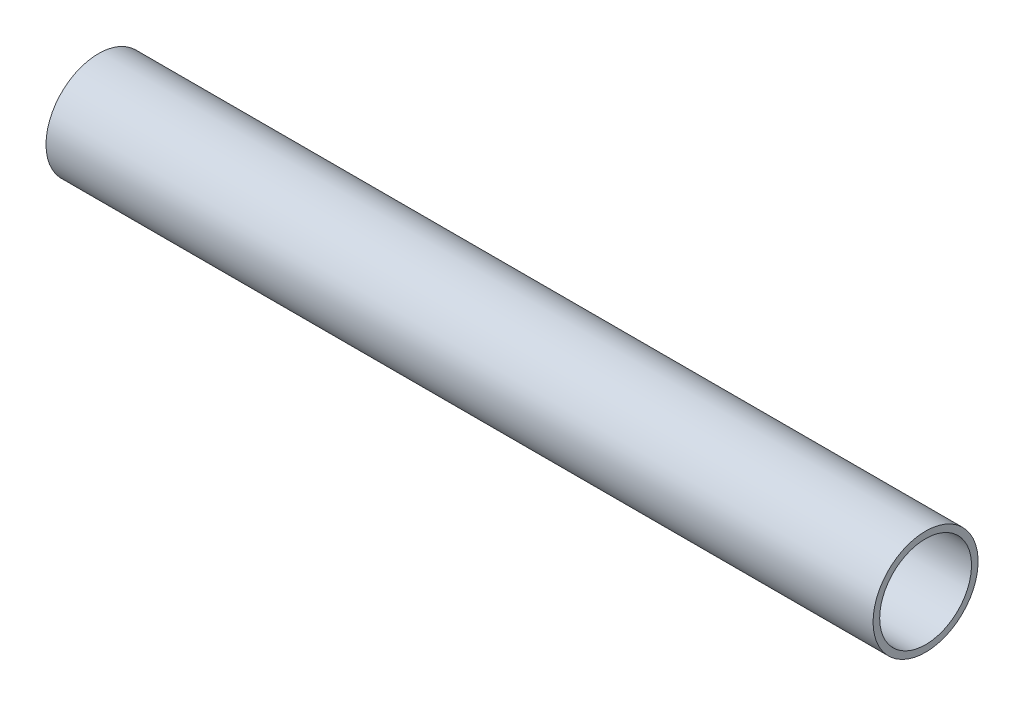
ISO-10303-21;
HEADER;
FILE_DESCRIPTION(('STEP AP214'),'2;1');
FILE_NAME('part.step','',(''),(''),'','','');
FILE_SCHEMA(('AUTOMOTIVE_DESIGN { 1 0 10303 214 1 1 1 1 }'));
ENDSEC;
DATA;
#1=APPLICATION_CONTEXT('core data for automotive mechanical design processes');
#2=APPLICATION_PROTOCOL_DEFINITION('international standard','automotive_design',2000,#1);
#3=PRODUCT_CONTEXT('',#1,'mechanical');
#4=PRODUCT('Part','Part','',(#3));
#5=PRODUCT_RELATED_PRODUCT_CATEGORY('part','',(#4));
#6=PRODUCT_DEFINITION_FORMATION('','',#4);
#7=PRODUCT_DEFINITION_CONTEXT('part definition',#1,'design');
#8=PRODUCT_DEFINITION('design','',#6,#7);
#9=PRODUCT_DEFINITION_SHAPE('','',#8);
#10=(LENGTH_UNIT() NAMED_UNIT(*) SI_UNIT(.MILLI.,.METRE.));
#11=(NAMED_UNIT(*) PLANE_ANGLE_UNIT() SI_UNIT($,.RADIAN.));
#12=(NAMED_UNIT(*) SI_UNIT($,.STERADIAN.) SOLID_ANGLE_UNIT());
#13=UNCERTAINTY_MEASURE_WITH_UNIT(LENGTH_MEASURE(1.E-05),#10,'distance_accuracy_value','');
#14=(GEOMETRIC_REPRESENTATION_CONTEXT(3) GLOBAL_UNCERTAINTY_ASSIGNED_CONTEXT((#13)) GLOBAL_UNIT_ASSIGNED_CONTEXT((#10,
#11,#12)) REPRESENTATION_CONTEXT('',''));
#15=CARTESIAN_POINT('',(0.,0.,0.));
#16=DIRECTION('',(0.,0.,1.));
#17=DIRECTION('',(1.,0.,0.));
#18=AXIS2_PLACEMENT_3D('',#15,#16,#17);
#19=CARTESIAN_POINT('',(600.,38.1,0.));
#20=DIRECTION('',(-1.,0.,0.));
#21=DIRECTION('',(0.,0.,1.));
#22=AXIS2_PLACEMENT_3D('',#19,#20,#21);
#23=PLANE('',#22);
#24=CARTESIAN_POINT('',(600.,0.,0.));
#25=DIRECTION('',(-1.,0.,0.));
#26=DIRECTION('',(0.,0.,1.));
#27=AXIS2_PLACEMENT_3D('',#24,#25,#26);
#28=CIRCLE('',#27,38.1);
#29=CARTESIAN_POINT('',(600.,0.,38.1));
#30=VERTEX_POINT('',#29);
#31=EDGE_CURVE('E10',#30,#30,#28,.T.);
#32=ORIENTED_EDGE('',*,*,#31,.F.);
#33=EDGE_LOOP('',(#32));
#34=FACE_BOUND('',#33,.T.);
#35=CARTESIAN_POINT('',(600.,0.,0.));
#36=DIRECTION('',(-1.,0.,0.));
#37=DIRECTION('',(0.,0.,1.));
#38=AXIS2_PLACEMENT_3D('',#35,#36,#37);
#39=CIRCLE('',#38,33.3);
#40=CARTESIAN_POINT('',(600.,0.,33.3));
#41=VERTEX_POINT('',#40);
#42=EDGE_CURVE('E44',#41,#41,#39,.T.);
#43=ORIENTED_EDGE('',*,*,#42,.T.);
#44=EDGE_LOOP('',(#43));
#45=FACE_BOUND('',#44,.T.);
#46=ADVANCED_FACE('F30',(#34,#45),#23,.F.);
#47=CARTESIAN_POINT('',(0.,0.,0.));
#48=DIRECTION('',(-1.,0.,0.));
#49=DIRECTION('',(0.,0.,1.));
#50=AXIS2_PLACEMENT_3D('',#47,#48,#49);
#51=CYLINDRICAL_SURFACE('',#50,38.1);
#52=CARTESIAN_POINT('',(0.,0.,0.));
#53=DIRECTION('',(-1.,0.,0.));
#54=DIRECTION('',(0.,0.,1.));
#55=AXIS2_PLACEMENT_3D('',#52,#53,#54);
#56=CIRCLE('',#55,38.1);
#57=CARTESIAN_POINT('',(0.,0.,38.1));
#58=VERTEX_POINT('',#57);
#59=EDGE_CURVE('E36',#58,#58,#56,.T.);
#60=ORIENTED_EDGE('',*,*,#59,.F.);
#61=EDGE_LOOP('',(#60));
#62=FACE_BOUND('',#61,.T.);
#63=ORIENTED_EDGE('',*,*,#31,.T.);
#64=EDGE_LOOP('',(#63));
#65=FACE_BOUND('',#64,.T.);
#66=ADVANCED_FACE('F59',(#62,#65),#51,.T.);
#67=CARTESIAN_POINT('',(0.,33.3,0.));
#68=DIRECTION('',(1.,0.,0.));
#69=DIRECTION('',(0.,0.,-1.));
#70=AXIS2_PLACEMENT_3D('',#67,#68,#69);
#71=PLANE('',#70);
#72=CARTESIAN_POINT('',(0.,0.,0.));
#73=DIRECTION('',(-1.,0.,0.));
#74=DIRECTION('',(0.,0.,1.));
#75=AXIS2_PLACEMENT_3D('',#72,#73,#74);
#76=CIRCLE('',#75,33.3);
#77=CARTESIAN_POINT('',(0.,0.,33.3));
#78=VERTEX_POINT('',#77);
#79=EDGE_CURVE('E40',#78,#78,#76,.T.);
#80=ORIENTED_EDGE('',*,*,#79,.F.);
#81=EDGE_LOOP('',(#80));
#82=FACE_BOUND('',#81,.T.);
#83=ORIENTED_EDGE('',*,*,#59,.T.);
#84=EDGE_LOOP('',(#83));
#85=FACE_BOUND('',#84,.T.);
#86=ADVANCED_FACE('F54',(#82,#85),#71,.F.);
#87=CARTESIAN_POINT('',(0.,0.,0.));
#88=DIRECTION('',(-1.,0.,0.));
#89=DIRECTION('',(0.,0.,1.));
#90=AXIS2_PLACEMENT_3D('',#87,#88,#89);
#91=CYLINDRICAL_SURFACE('',#90,33.3);
#92=ORIENTED_EDGE('',*,*,#42,.F.);
#93=EDGE_LOOP('',(#92));
#94=FACE_BOUND('',#93,.T.);
#95=ORIENTED_EDGE('',*,*,#79,.T.);
#96=EDGE_LOOP('',(#95));
#97=FACE_BOUND('',#96,.T.);
#98=ADVANCED_FACE('F51',(#94,#97),#91,.F.);
#99=CLOSED_SHELL('',(#46,#66,#86,#98));
#100=MANIFOLD_SOLID_BREP('B2',#99);
#101=ADVANCED_BREP_SHAPE_REPRESENTATION('',(#18,#100),#14);
#102=SHAPE_DEFINITION_REPRESENTATION(#9,#101);
ENDSEC;
END-ISO-10303-21;
